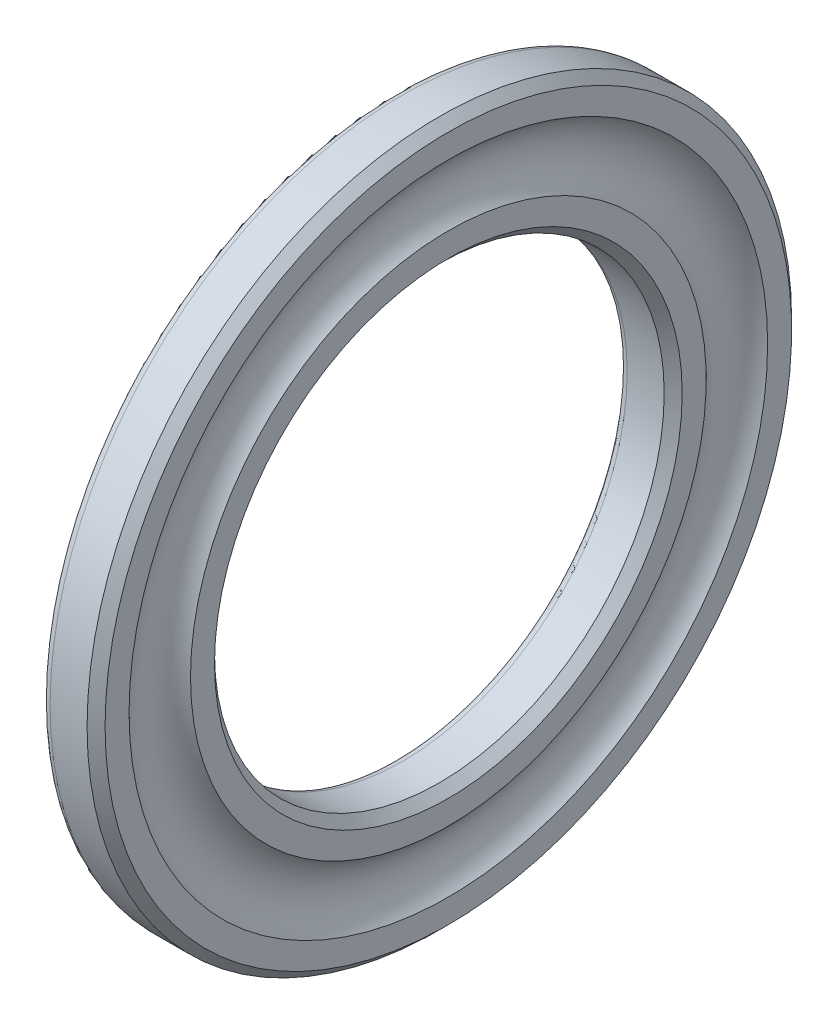
ISO-10303-21;
HEADER;
FILE_DESCRIPTION(('STEP AP214'),'2;1');
FILE_NAME('part.step','',(''),(''),'','','');
FILE_SCHEMA(('AUTOMOTIVE_DESIGN { 1 0 10303 214 1 1 1 1 }'));
ENDSEC;
DATA;
#1=APPLICATION_CONTEXT('core data for automotive mechanical design processes');
#2=APPLICATION_PROTOCOL_DEFINITION('international standard','automotive_design',2000,#1);
#3=PRODUCT_CONTEXT('',#1,'mechanical');
#4=PRODUCT('Part','Part','',(#3));
#5=PRODUCT_RELATED_PRODUCT_CATEGORY('part','',(#4));
#6=PRODUCT_DEFINITION_FORMATION('','',#4);
#7=PRODUCT_DEFINITION_CONTEXT('part definition',#1,'design');
#8=PRODUCT_DEFINITION('design','',#6,#7);
#9=PRODUCT_DEFINITION_SHAPE('','',#8);
#10=(LENGTH_UNIT() NAMED_UNIT(*) SI_UNIT(.MILLI.,.METRE.));
#11=(NAMED_UNIT(*) PLANE_ANGLE_UNIT() SI_UNIT($,.RADIAN.));
#12=(NAMED_UNIT(*) SI_UNIT($,.STERADIAN.) SOLID_ANGLE_UNIT());
#13=UNCERTAINTY_MEASURE_WITH_UNIT(LENGTH_MEASURE(1.E-05),#10,'distance_accuracy_value','');
#14=(GEOMETRIC_REPRESENTATION_CONTEXT(3) GLOBAL_UNCERTAINTY_ASSIGNED_CONTEXT((#13)) GLOBAL_UNIT_ASSIGNED_CONTEXT((#10,
#11,#12)) REPRESENTATION_CONTEXT('',''));
#15=CARTESIAN_POINT('',(0.,0.,0.));
#16=DIRECTION('',(0.,0.,1.));
#17=DIRECTION('',(1.,0.,0.));
#18=AXIS2_PLACEMENT_3D('',#15,#16,#17);
#19=CARTESIAN_POINT('',(0.6,0.,0.));
#20=DIRECTION('',(-1.,0.,0.));
#21=DIRECTION('',(0.,0.,1.));
#22=AXIS2_PLACEMENT_3D('',#19,#20,#21);
#23=TOROIDAL_SURFACE('',#22,15.6,0.6);
#24=CARTESIAN_POINT('',(0.6,0.,0.));
#25=DIRECTION('',(-1.,0.,0.));
#26=DIRECTION('',(0.,0.,1.));
#27=AXIS2_PLACEMENT_3D('',#24,#25,#26);
#28=CIRCLE('',#27,15.);
#29=CARTESIAN_POINT('',(0.6,0.,15.));
#30=VERTEX_POINT('',#29);
#31=EDGE_CURVE('E10',#30,#30,#28,.T.);
#32=ORIENTED_EDGE('',*,*,#31,.F.);
#33=EDGE_LOOP('',(#32));
#34=FACE_BOUND('',#33,.T.);
#35=CARTESIAN_POINT('',(0.,0.,0.));
#36=DIRECTION('',(-1.,0.,0.));
#37=DIRECTION('',(0.,0.,1.));
#38=AXIS2_PLACEMENT_3D('',#35,#36,#37);
#39=CIRCLE('',#38,15.6);
#40=CARTESIAN_POINT('',(0.,0.,15.6));
#41=VERTEX_POINT('',#40);
#42=EDGE_CURVE('E64',#41,#41,#39,.T.);
#43=ORIENTED_EDGE('',*,*,#42,.T.);
#44=EDGE_LOOP('',(#43));
#45=FACE_BOUND('',#44,.T.);
#46=ADVANCED_FACE('F14',(#34,#45),#23,.T.);
#47=CARTESIAN_POINT('',(0.,0.,0.));
#48=DIRECTION('',(-1.,0.,0.));
#49=DIRECTION('',(0.,0.,1.));
#50=AXIS2_PLACEMENT_3D('',#47,#48,#49);
#51=CYLINDRICAL_SURFACE('',#50,15.);
#52=CARTESIAN_POINT('',(3.06666666666667,0.,0.));
#53=DIRECTION('',(-1.,0.,0.));
#54=DIRECTION('',(0.,0.,1.));
#55=AXIS2_PLACEMENT_3D('',#52,#53,#54);
#56=CIRCLE('',#55,15.);
#57=CARTESIAN_POINT('',(3.06666666666667,0.,15.));
#58=VERTEX_POINT('',#57);
#59=EDGE_CURVE('E21',#58,#58,#56,.T.);
#60=ORIENTED_EDGE('',*,*,#59,.F.);
#61=EDGE_LOOP('',(#60));
#62=FACE_BOUND('',#61,.T.);
#63=ORIENTED_EDGE('',*,*,#31,.T.);
#64=EDGE_LOOP('',(#63));
#65=FACE_BOUND('',#64,.T.);
#66=ADVANCED_FACE('F113',(#62,#65),#51,.F.);
#67=CARTESIAN_POINT('',(3.06666666666667,0.,0.));
#68=DIRECTION('',(1.,0.,0.));
#69=DIRECTION('',(0.,0.,-1.));
#70=AXIS2_PLACEMENT_3D('',#67,#68,#69);
#71=CONICAL_SURFACE('',#70,15.,0.785398163397449);
#72=CARTESIAN_POINT('',(3.66666666666666,0.,0.));
#73=DIRECTION('',(-1.,0.,0.));
#74=DIRECTION('',(0.,0.,1.));
#75=AXIS2_PLACEMENT_3D('',#72,#73,#74);
#76=CIRCLE('',#75,15.6);
#77=CARTESIAN_POINT('',(3.66666666666666,0.,15.6));
#78=VERTEX_POINT('',#77);
#79=EDGE_CURVE('E30',#78,#78,#76,.T.);
#80=ORIENTED_EDGE('',*,*,#79,.F.);
#81=EDGE_LOOP('',(#80));
#82=FACE_BOUND('',#81,.T.);
#83=ORIENTED_EDGE('',*,*,#59,.T.);
#84=EDGE_LOOP('',(#83));
#85=FACE_BOUND('',#84,.T.);
#86=ADVANCED_FACE('F109',(#82,#85),#71,.F.);
#87=CARTESIAN_POINT('',(3.66666666666666,15.6,0.));
#88=DIRECTION('',(-1.,0.,0.));
#89=DIRECTION('',(0.,0.,1.));
#90=AXIS2_PLACEMENT_3D('',#87,#88,#89);
#91=PLANE('',#90);
#92=CARTESIAN_POINT('',(3.66666666666666,0.,0.));
#93=DIRECTION('',(-1.,0.,0.));
#94=DIRECTION('',(0.,0.,1.));
#95=AXIS2_PLACEMENT_3D('',#92,#93,#94);
#96=CIRCLE('',#95,17.2002710206252);
#97=CARTESIAN_POINT('',(3.66666666666666,0.,17.2002710206252));
#98=VERTEX_POINT('',#97);
#99=EDGE_CURVE('E38',#98,#98,#96,.T.);
#100=ORIENTED_EDGE('',*,*,#99,.F.);
#101=EDGE_LOOP('',(#100));
#102=FACE_BOUND('',#101,.T.);
#103=ORIENTED_EDGE('',*,*,#79,.T.);
#104=EDGE_LOOP('',(#103));
#105=FACE_BOUND('',#104,.T.);
#106=ADVANCED_FACE('F102',(#102,#105),#91,.F.);
#107=CARTESIAN_POINT('',(5.5,0.,0.));
#108=DIRECTION('',(-1.,0.,0.));
#109=DIRECTION('',(0.,0.,1.));
#110=AXIS2_PLACEMENT_3D('',#107,#108,#109);
#111=TOROIDAL_SURFACE('',#110,19.25,2.75);
#112=ORIENTED_EDGE('',*,*,#99,.T.);
#113=EDGE_LOOP('',(#112));
#114=FACE_BOUND('',#113,.T.);
#115=CARTESIAN_POINT('',(3.66666666666666,0.,0.));
#116=DIRECTION('',(-1.,0.,0.));
#117=DIRECTION('',(0.,0.,1.));
#118=AXIS2_PLACEMENT_3D('',#115,#116,#117);
#119=CIRCLE('',#118,21.2997289793748);
#120=CARTESIAN_POINT('',(3.66666666666666,0.,21.2997289793748));
#121=VERTEX_POINT('',#120);
#122=EDGE_CURVE('E44',#121,#121,#119,.T.);
#123=ORIENTED_EDGE('',*,*,#122,.F.);
#124=EDGE_LOOP('',(#123));
#125=FACE_BOUND('',#124,.T.);
#126=ADVANCED_FACE('F97',(#114,#125),#111,.F.);
#127=CARTESIAN_POINT('',(3.66666666666666,21.2997289793748,0.));
#128=DIRECTION('',(-1.,0.,0.));
#129=DIRECTION('',(0.,0.,1.));
#130=AXIS2_PLACEMENT_3D('',#127,#128,#129);
#131=PLANE('',#130);
#132=CARTESIAN_POINT('',(3.66666666666666,0.,0.));
#133=DIRECTION('',(-1.,0.,0.));
#134=DIRECTION('',(0.,0.,1.));
#135=AXIS2_PLACEMENT_3D('',#132,#133,#134);
#136=CIRCLE('',#135,22.9);
#137=CARTESIAN_POINT('',(3.66666666666666,0.,22.9));
#138=VERTEX_POINT('',#137);
#139=EDGE_CURVE('E48',#138,#138,#136,.T.);
#140=ORIENTED_EDGE('',*,*,#139,.F.);
#141=EDGE_LOOP('',(#140));
#142=FACE_BOUND('',#141,.T.);
#143=ORIENTED_EDGE('',*,*,#122,.T.);
#144=EDGE_LOOP('',(#143));
#145=FACE_BOUND('',#144,.T.);
#146=ADVANCED_FACE('F91',(#142,#145),#131,.F.);
#147=CARTESIAN_POINT('',(3.66666666666666,0.,0.));
#148=DIRECTION('',(-1.,0.,0.));
#149=DIRECTION('',(0.,0.,1.));
#150=AXIS2_PLACEMENT_3D('',#147,#148,#149);
#151=CONICAL_SURFACE('',#150,22.9,0.785398163397449);
#152=CARTESIAN_POINT('',(3.06666666666667,0.,0.));
#153=DIRECTION('',(-1.,0.,0.));
#154=DIRECTION('',(0.,0.,1.));
#155=AXIS2_PLACEMENT_3D('',#152,#153,#154);
#156=CIRCLE('',#155,23.5);
#157=CARTESIAN_POINT('',(3.06666666666667,0.,23.5));
#158=VERTEX_POINT('',#157);
#159=EDGE_CURVE('E52',#158,#158,#156,.T.);
#160=ORIENTED_EDGE('',*,*,#159,.F.);
#161=EDGE_LOOP('',(#160));
#162=FACE_BOUND('',#161,.T.);
#163=ORIENTED_EDGE('',*,*,#139,.T.);
#164=EDGE_LOOP('',(#163));
#165=FACE_BOUND('',#164,.T.);
#166=ADVANCED_FACE('F85',(#162,#165),#151,.T.);
#167=CARTESIAN_POINT('',(0.,0.,0.));
#168=DIRECTION('',(-1.,0.,0.));
#169=DIRECTION('',(0.,0.,1.));
#170=AXIS2_PLACEMENT_3D('',#167,#168,#169);
#171=CYLINDRICAL_SURFACE('',#170,23.5);
#172=CARTESIAN_POINT('',(0.6,0.,0.));
#173=DIRECTION('',(-1.,0.,0.));
#174=DIRECTION('',(0.,0.,1.));
#175=AXIS2_PLACEMENT_3D('',#172,#173,#174);
#176=CIRCLE('',#175,23.5);
#177=CARTESIAN_POINT('',(0.6,0.,23.5));
#178=VERTEX_POINT('',#177);
#179=EDGE_CURVE('E56',#178,#178,#176,.T.);
#180=ORIENTED_EDGE('',*,*,#179,.F.);
#181=EDGE_LOOP('',(#180));
#182=FACE_BOUND('',#181,.T.);
#183=ORIENTED_EDGE('',*,*,#159,.T.);
#184=EDGE_LOOP('',(#183));
#185=FACE_BOUND('',#184,.T.);
#186=ADVANCED_FACE('F79',(#182,#185),#171,.T.);
#187=CARTESIAN_POINT('',(0.6,0.,0.));
#188=DIRECTION('',(-1.,0.,0.));
#189=DIRECTION('',(0.,0.,1.));
#190=AXIS2_PLACEMENT_3D('',#187,#188,#189);
#191=TOROIDAL_SURFACE('',#190,22.9,0.6);
#192=CARTESIAN_POINT('',(0.,0.,0.));
#193=DIRECTION('',(-1.,0.,0.));
#194=DIRECTION('',(0.,0.,1.));
#195=AXIS2_PLACEMENT_3D('',#192,#193,#194);
#196=CIRCLE('',#195,22.9);
#197=CARTESIAN_POINT('',(0.,0.,22.9));
#198=VERTEX_POINT('',#197);
#199=EDGE_CURVE('E60',#198,#198,#196,.T.);
#200=ORIENTED_EDGE('',*,*,#199,.F.);
#201=EDGE_LOOP('',(#200));
#202=FACE_BOUND('',#201,.T.);
#203=ORIENTED_EDGE('',*,*,#179,.T.);
#204=EDGE_LOOP('',(#203));
#205=FACE_BOUND('',#204,.T.);
#206=ADVANCED_FACE('F73',(#202,#205),#191,.T.);
#207=CARTESIAN_POINT('',(0.,22.9,0.));
#208=DIRECTION('',(1.,0.,0.));
#209=DIRECTION('',(0.,0.,-1.));
#210=AXIS2_PLACEMENT_3D('',#207,#208,#209);
#211=PLANE('',#210);
#212=ORIENTED_EDGE('',*,*,#42,.F.);
#213=EDGE_LOOP('',(#212));
#214=FACE_BOUND('',#213,.T.);
#215=ORIENTED_EDGE('',*,*,#199,.T.);
#216=EDGE_LOOP('',(#215));
#217=FACE_BOUND('',#216,.T.);
#218=ADVANCED_FACE('F70',(#214,#217),#211,.F.);
#219=CLOSED_SHELL('',(#46,#66,#86,#106,#126,#146,#166,#186,#206,#218));
#220=MANIFOLD_SOLID_BREP('B1',#219);
#221=ADVANCED_BREP_SHAPE_REPRESENTATION('',(#18,#220),#14);
#222=SHAPE_DEFINITION_REPRESENTATION(#9,#221);
ENDSEC;
END-ISO-10303-21;
